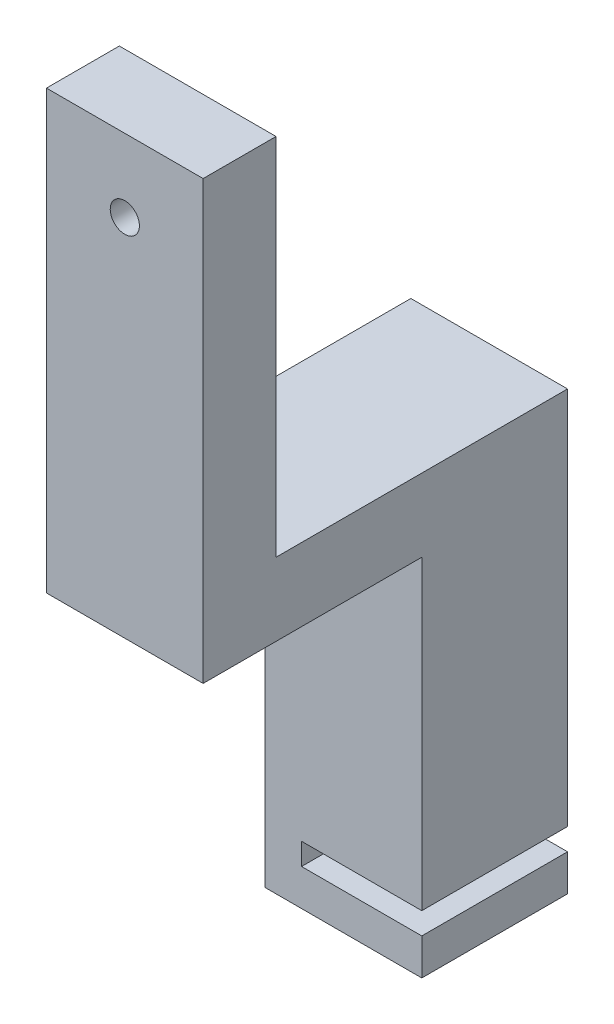
ISO-10303-21;
HEADER;
FILE_DESCRIPTION(('STEP AP214'),'2;1');
FILE_NAME('part.step','',(''),(''),'','','');
FILE_SCHEMA(('AUTOMOTIVE_DESIGN { 1 0 10303 214 1 1 1 1 }'));
ENDSEC;
DATA;
#1=APPLICATION_CONTEXT('core data for automotive mechanical design processes');
#2=APPLICATION_PROTOCOL_DEFINITION('international standard','automotive_design',2000,#1);
#3=PRODUCT_CONTEXT('',#1,'mechanical');
#4=PRODUCT('Part','Part','',(#3));
#5=PRODUCT_RELATED_PRODUCT_CATEGORY('part','',(#4));
#6=PRODUCT_DEFINITION_FORMATION('','',#4);
#7=PRODUCT_DEFINITION_CONTEXT('part definition',#1,'design');
#8=PRODUCT_DEFINITION('design','',#6,#7);
#9=PRODUCT_DEFINITION_SHAPE('','',#8);
#10=(LENGTH_UNIT() NAMED_UNIT(*) SI_UNIT(.MILLI.,.METRE.));
#11=(NAMED_UNIT(*) PLANE_ANGLE_UNIT() SI_UNIT($,.RADIAN.));
#12=(NAMED_UNIT(*) SI_UNIT($,.STERADIAN.) SOLID_ANGLE_UNIT());
#13=UNCERTAINTY_MEASURE_WITH_UNIT(LENGTH_MEASURE(1.E-05),#10,'distance_accuracy_value','');
#14=(GEOMETRIC_REPRESENTATION_CONTEXT(3) GLOBAL_UNCERTAINTY_ASSIGNED_CONTEXT((#13)) GLOBAL_UNIT_ASSIGNED_CONTEXT((#10,
#11,#12)) REPRESENTATION_CONTEXT('',''));
#15=CARTESIAN_POINT('',(0.,0.,0.));
#16=DIRECTION('',(0.,0.,1.));
#17=DIRECTION('',(1.,0.,0.));
#18=AXIS2_PLACEMENT_3D('',#15,#16,#17);
#19=CARTESIAN_POINT('',(0.,0.,20.));
#20=DIRECTION('',(-1.,0.,0.));
#21=DIRECTION('',(0.,-1.,0.));
#22=AXIS2_PLACEMENT_3D('',#19,#20,#21);
#23=PLANE('',#22);
#24=DIRECTION('',(0.,1.,0.));
#25=VECTOR('',#24,1.);
#26=CARTESIAN_POINT('',(0.,0.,0.));
#27=LINE('',#26,#25);
#28=CARTESIAN_POINT('',(0.,0.,0.));
#29=VERTEX_POINT('',#28);
#30=CARTESIAN_POINT('',(0.,5.,0.));
#31=VERTEX_POINT('',#30);
#32=EDGE_CURVE('E217',#29,#31,#27,.T.);
#33=ORIENTED_EDGE('',*,*,#32,.T.);
#34=DIRECTION('',(0.,0.,-1.));
#35=VECTOR('',#34,1.);
#36=CARTESIAN_POINT('',(0.,5.,20.));
#37=LINE('',#36,#35);
#38=CARTESIAN_POINT('',(0.,5.,20.));
#39=VERTEX_POINT('',#38);
#40=EDGE_CURVE('E175',#39,#31,#37,.T.);
#41=ORIENTED_EDGE('',*,*,#40,.F.);
#42=DIRECTION('',(0.,1.,0.));
#43=VECTOR('',#42,1.);
#44=CARTESIAN_POINT('',(0.,0.,20.));
#45=LINE('',#44,#43);
#46=CARTESIAN_POINT('',(0.,0.,20.));
#47=VERTEX_POINT('',#46);
#48=EDGE_CURVE('E202',#47,#39,#45,.T.);
#49=ORIENTED_EDGE('',*,*,#48,.F.);
#50=DIRECTION('',(0.,0.,-1.));
#51=VECTOR('',#50,1.);
#52=CARTESIAN_POINT('',(0.,0.,20.));
#53=LINE('',#52,#51);
#54=EDGE_CURVE('E203',#47,#29,#53,.T.);
#55=ORIENTED_EDGE('',*,*,#54,.T.);
#56=EDGE_LOOP('',(#33,#41,#49,#55));
#57=FACE_BOUND('',#56,.T.);
#58=ADVANCED_FACE('F41',(#57),#23,.F.);
#59=CARTESIAN_POINT('',(0.,5.,20.));
#60=DIRECTION('',(0.,-1.,0.));
#61=DIRECTION('',(1.,0.,0.));
#62=AXIS2_PLACEMENT_3D('',#59,#60,#61);
#63=PLANE('',#62);
#64=DIRECTION('',(-1.,0.,0.));
#65=VECTOR('',#64,1.);
#66=CARTESIAN_POINT('',(0.,5.,0.));
#67=LINE('',#66,#65);
#68=CARTESIAN_POINT('',(-16.5,5.,0.));
#69=VERTEX_POINT('',#68);
#70=EDGE_CURVE('E219',#31,#69,#67,.T.);
#71=ORIENTED_EDGE('',*,*,#70,.T.);
#72=DIRECTION('',(0.,0.,-1.));
#73=VECTOR('',#72,1.);
#74=CARTESIAN_POINT('',(-16.5,5.,20.));
#75=LINE('',#74,#73);
#76=CARTESIAN_POINT('',(-16.5,5.,20.));
#77=VERTEX_POINT('',#76);
#78=EDGE_CURVE('E171',#77,#69,#75,.T.);
#79=ORIENTED_EDGE('',*,*,#78,.F.);
#80=DIRECTION('',(-1.,0.,0.));
#81=VECTOR('',#80,1.);
#82=CARTESIAN_POINT('',(0.,5.,20.));
#83=LINE('',#82,#81);
#84=EDGE_CURVE('E249',#39,#77,#83,.T.);
#85=ORIENTED_EDGE('',*,*,#84,.F.);
#86=ORIENTED_EDGE('',*,*,#40,.T.);
#87=EDGE_LOOP('',(#71,#79,#85,#86));
#88=FACE_BOUND('',#87,.T.);
#89=ADVANCED_FACE('F311',(#88),#63,.F.);
#90=CARTESIAN_POINT('',(-16.5,8.,20.));
#91=DIRECTION('',(-1.,0.,0.));
#92=DIRECTION('',(0.,0.,1.));
#93=AXIS2_PLACEMENT_3D('',#90,#91,#92);
#94=PLANE('',#93);
#95=DIRECTION('',(0.,1.,0.));
#96=VECTOR('',#95,1.);
#97=CARTESIAN_POINT('',(-16.5,8.,0.));
#98=LINE('',#97,#96);
#99=CARTESIAN_POINT('',(-16.5,8.,0.));
#100=VERTEX_POINT('',#99);
#101=EDGE_CURVE('E196',#69,#100,#98,.T.);
#102=ORIENTED_EDGE('',*,*,#101,.T.);
#103=DIRECTION('',(0.,0.,-1.));
#104=VECTOR('',#103,1.);
#105=CARTESIAN_POINT('',(-16.5,8.,20.));
#106=LINE('',#105,#104);
#107=CARTESIAN_POINT('',(-16.5,8.,20.));
#108=VERTEX_POINT('',#107);
#109=EDGE_CURVE('E162',#108,#100,#106,.T.);
#110=ORIENTED_EDGE('',*,*,#109,.F.);
#111=DIRECTION('',(0.,1.,0.));
#112=VECTOR('',#111,1.);
#113=CARTESIAN_POINT('',(-16.5,8.,20.));
#114=LINE('',#113,#112);
#115=EDGE_CURVE('E243',#77,#108,#114,.T.);
#116=ORIENTED_EDGE('',*,*,#115,.F.);
#117=ORIENTED_EDGE('',*,*,#78,.T.);
#118=EDGE_LOOP('',(#102,#110,#116,#117));
#119=FACE_BOUND('',#118,.T.);
#120=ADVANCED_FACE('F235',(#119),#94,.F.);
#121=CARTESIAN_POINT('',(0.,8.,20.));
#122=DIRECTION('',(0.,1.,0.));
#123=DIRECTION('',(-1.,0.,0.));
#124=AXIS2_PLACEMENT_3D('',#121,#122,#123);
#125=PLANE('',#124);
#126=DIRECTION('',(1.,0.,0.));
#127=VECTOR('',#126,1.);
#128=CARTESIAN_POINT('',(0.,8.,0.));
#129=LINE('',#128,#127);
#130=CARTESIAN_POINT('',(0.,8.,0.));
#131=VERTEX_POINT('',#130);
#132=EDGE_CURVE('E190',#100,#131,#129,.T.);
#133=ORIENTED_EDGE('',*,*,#132,.T.);
#134=DIRECTION('',(0.,0.,-1.));
#135=VECTOR('',#134,1.);
#136=CARTESIAN_POINT('',(0.,8.,20.));
#137=LINE('',#136,#135);
#138=CARTESIAN_POINT('',(0.,8.,20.));
#139=VERTEX_POINT('',#138);
#140=EDGE_CURVE('E156',#139,#131,#137,.T.);
#141=ORIENTED_EDGE('',*,*,#140,.F.);
#142=DIRECTION('',(1.,0.,0.));
#143=VECTOR('',#142,1.);
#144=CARTESIAN_POINT('',(0.,8.,20.));
#145=LINE('',#144,#143);
#146=EDGE_CURVE('E241',#108,#139,#145,.T.);
#147=ORIENTED_EDGE('',*,*,#146,.F.);
#148=ORIENTED_EDGE('',*,*,#109,.T.);
#149=EDGE_LOOP('',(#133,#141,#147,#148));
#150=FACE_BOUND('',#149,.T.);
#151=ADVANCED_FACE('F240',(#150),#125,.F.);
#152=CARTESIAN_POINT('',(0.,50.,20.));
#153=DIRECTION('',(-1.,0.,0.));
#154=DIRECTION('',(0.,0.,1.));
#155=AXIS2_PLACEMENT_3D('',#152,#153,#154);
#156=PLANE('',#155);
#157=DIRECTION('',(0.,1.,0.));
#158=VECTOR('',#157,1.);
#159=CARTESIAN_POINT('',(0.,50.,0.));
#160=LINE('',#159,#158);
#161=CARTESIAN_POINT('',(0.,60.,0.));
#162=VERTEX_POINT('',#161);
#163=EDGE_CURVE('E183',#131,#162,#160,.T.);
#164=ORIENTED_EDGE('',*,*,#163,.T.);
#165=DIRECTION('',(0.,0.,-1.));
#166=VECTOR('',#165,1.);
#167=CARTESIAN_POINT('',(0.,60.,0.));
#168=LINE('',#167,#166);
#169=CARTESIAN_POINT('',(0.,60.,40.));
#170=VERTEX_POINT('',#169);
#171=EDGE_CURVE('E56',#170,#162,#168,.T.);
#172=ORIENTED_EDGE('',*,*,#171,.F.);
#173=DIRECTION('',(0.,-1.,0.));
#174=VECTOR('',#173,1.);
#175=CARTESIAN_POINT('',(0.,110.,40.));
#176=LINE('',#175,#174);
#177=CARTESIAN_POINT('',(0.,110.,40.));
#178=VERTEX_POINT('',#177);
#179=EDGE_CURVE('E135',#178,#170,#176,.T.);
#180=ORIENTED_EDGE('',*,*,#179,.F.);
#181=DIRECTION('',(0.,0.,-1.));
#182=VECTOR('',#181,1.);
#183=CARTESIAN_POINT('',(0.,110.,20.));
#184=LINE('',#183,#182);
#185=CARTESIAN_POINT('',(0.,110.,50.));
#186=VERTEX_POINT('',#185);
#187=EDGE_CURVE('E146',#186,#178,#184,.T.);
#188=ORIENTED_EDGE('',*,*,#187,.F.);
#189=DIRECTION('',(0.,1.,0.));
#190=VECTOR('',#189,1.);
#191=CARTESIAN_POINT('',(0.,0.,50.));
#192=LINE('',#191,#190);
#193=CARTESIAN_POINT('',(0.,50.,50.));
#194=VERTEX_POINT('',#193);
#195=EDGE_CURVE('E274',#194,#186,#192,.T.);
#196=ORIENTED_EDGE('',*,*,#195,.F.);
#197=DIRECTION('',(0.,0.,-1.));
#198=VECTOR('',#197,1.);
#199=CARTESIAN_POINT('',(0.,50.,50.));
#200=LINE('',#199,#198);
#201=CARTESIAN_POINT('',(0.,50.,20.));
#202=VERTEX_POINT('',#201);
#203=EDGE_CURVE('E228',#194,#202,#200,.T.);
#204=ORIENTED_EDGE('',*,*,#203,.T.);
#205=DIRECTION('',(0.,1.,0.));
#206=VECTOR('',#205,1.);
#207=CARTESIAN_POINT('',(0.,8.,20.));
#208=LINE('',#207,#206);
#209=EDGE_CURVE('E64',#139,#202,#208,.T.);
#210=ORIENTED_EDGE('',*,*,#209,.F.);
#211=ORIENTED_EDGE('',*,*,#140,.T.);
#212=EDGE_LOOP('',(#164,#172,#180,#188,#196,#204,#210,#211));
#213=FACE_BOUND('',#212,.T.);
#214=ADVANCED_FACE('F144',(#213),#156,.F.);
#215=CARTESIAN_POINT('',(-21.5,110.,20.));
#216=DIRECTION('',(0.,-1.,0.));
#217=DIRECTION('',(0.,0.,-1.));
#218=AXIS2_PLACEMENT_3D('',#215,#216,#217);
#219=PLANE('',#218);
#220=ORIENTED_EDGE('',*,*,#187,.T.);
#221=DIRECTION('',(1.,0.,0.));
#222=VECTOR('',#221,1.);
#223=CARTESIAN_POINT('',(-50.,110.,40.));
#224=LINE('',#223,#222);
#225=CARTESIAN_POINT('',(-21.5,110.,40.));
#226=VERTEX_POINT('',#225);
#227=EDGE_CURVE('E131',#226,#178,#224,.T.);
#228=ORIENTED_EDGE('',*,*,#227,.F.);
#229=DIRECTION('',(0.,0.,-1.));
#230=VECTOR('',#229,1.);
#231=CARTESIAN_POINT('',(-21.5,110.,20.));
#232=LINE('',#231,#230);
#233=CARTESIAN_POINT('',(-21.5,110.,50.));
#234=VERTEX_POINT('',#233);
#235=EDGE_CURVE('E157',#234,#226,#232,.T.);
#236=ORIENTED_EDGE('',*,*,#235,.F.);
#237=DIRECTION('',(1.,0.,0.));
#238=VECTOR('',#237,1.);
#239=CARTESIAN_POINT('',(0.,110.,50.));
#240=LINE('',#239,#238);
#241=EDGE_CURVE('E154',#234,#186,#240,.T.);
#242=ORIENTED_EDGE('',*,*,#241,.T.);
#243=EDGE_LOOP('',(#220,#228,#236,#242));
#244=FACE_BOUND('',#243,.T.);
#245=ADVANCED_FACE('F152',(#244),#219,.F.);
#246=CARTESIAN_POINT('',(-21.5,0.,20.));
#247=DIRECTION('',(1.,0.,0.));
#248=DIRECTION('',(0.,0.,-1.));
#249=AXIS2_PLACEMENT_3D('',#246,#247,#248);
#250=PLANE('',#249);
#251=DIRECTION('',(0.,-1.,0.));
#252=VECTOR('',#251,1.);
#253=CARTESIAN_POINT('',(-21.5,0.,40.));
#254=LINE('',#253,#252);
#255=CARTESIAN_POINT('',(-21.5,60.,40.));
#256=VERTEX_POINT('',#255);
#257=EDGE_CURVE('E11',#226,#256,#254,.T.);
#258=ORIENTED_EDGE('',*,*,#257,.T.);
#259=DIRECTION('',(0.,0.,-1.));
#260=VECTOR('',#259,1.);
#261=CARTESIAN_POINT('',(-21.5,60.,20.));
#262=LINE('',#261,#260);
#263=CARTESIAN_POINT('',(-21.5,60.,0.));
#264=VERTEX_POINT('',#263);
#265=EDGE_CURVE('E281',#256,#264,#262,.T.);
#266=ORIENTED_EDGE('',*,*,#265,.T.);
#267=DIRECTION('',(0.,-1.,0.));
#268=VECTOR('',#267,1.);
#269=CARTESIAN_POINT('',(-21.5,0.,0.));
#270=LINE('',#269,#268);
#271=CARTESIAN_POINT('',(-21.5,0.,0.));
#272=VERTEX_POINT('',#271);
#273=EDGE_CURVE('E186',#264,#272,#270,.T.);
#274=ORIENTED_EDGE('',*,*,#273,.T.);
#275=DIRECTION('',(0.,0.,-1.));
#276=VECTOR('',#275,1.);
#277=CARTESIAN_POINT('',(-21.5,0.,20.));
#278=LINE('',#277,#276);
#279=CARTESIAN_POINT('',(-21.5,0.,20.));
#280=VERTEX_POINT('',#279);
#281=EDGE_CURVE('E164',#280,#272,#278,.T.);
#282=ORIENTED_EDGE('',*,*,#281,.F.);
#283=DIRECTION('',(0.,-1.,0.));
#284=VECTOR('',#283,1.);
#285=CARTESIAN_POINT('',(-21.5,50.,20.));
#286=LINE('',#285,#284);
#287=CARTESIAN_POINT('',(-21.5,50.,20.));
#288=VERTEX_POINT('',#287);
#289=EDGE_CURVE('E247',#288,#280,#286,.T.);
#290=ORIENTED_EDGE('',*,*,#289,.F.);
#291=DIRECTION('',(0.,0.,-1.));
#292=VECTOR('',#291,1.);
#293=CARTESIAN_POINT('',(-21.5,50.,50.));
#294=LINE('',#293,#292);
#295=CARTESIAN_POINT('',(-21.5,50.,50.));
#296=VERTEX_POINT('',#295);
#297=EDGE_CURVE('E264',#296,#288,#294,.T.);
#298=ORIENTED_EDGE('',*,*,#297,.F.);
#299=DIRECTION('',(0.,1.,0.));
#300=VECTOR('',#299,1.);
#301=CARTESIAN_POINT('',(-21.5,0.,50.));
#302=LINE('',#301,#300);
#303=EDGE_CURVE('E268',#296,#234,#302,.T.);
#304=ORIENTED_EDGE('',*,*,#303,.T.);
#305=ORIENTED_EDGE('',*,*,#235,.T.);
#306=EDGE_LOOP('',(#258,#266,#274,#282,#290,#298,#304,#305));
#307=FACE_BOUND('',#306,.T.);
#308=ADVANCED_FACE('F327',(#307),#250,.F.);
#309=CARTESIAN_POINT('',(0.,0.,20.));
#310=DIRECTION('',(0.,1.,0.));
#311=DIRECTION('',(0.,0.,1.));
#312=AXIS2_PLACEMENT_3D('',#309,#310,#311);
#313=PLANE('',#312);
#314=DIRECTION('',(1.,0.,0.));
#315=VECTOR('',#314,1.);
#316=CARTESIAN_POINT('',(0.,0.,0.));
#317=LINE('',#316,#315);
#318=EDGE_CURVE('E194',#272,#29,#317,.T.);
#319=ORIENTED_EDGE('',*,*,#318,.T.);
#320=ORIENTED_EDGE('',*,*,#54,.F.);
#321=DIRECTION('',(1.,0.,0.));
#322=VECTOR('',#321,1.);
#323=CARTESIAN_POINT('',(0.,0.,20.));
#324=LINE('',#323,#322);
#325=EDGE_CURVE('E206',#280,#47,#324,.T.);
#326=ORIENTED_EDGE('',*,*,#325,.F.);
#327=ORIENTED_EDGE('',*,*,#281,.T.);
#328=EDGE_LOOP('',(#319,#320,#326,#327));
#329=FACE_BOUND('',#328,.T.);
#330=ADVANCED_FACE('F212',(#329),#313,.F.);
#331=CARTESIAN_POINT('',(0.,0.,20.));
#332=DIRECTION('',(0.,0.,1.));
#333=DIRECTION('',(1.,0.,0.));
#334=AXIS2_PLACEMENT_3D('',#331,#332,#333);
#335=PLANE('',#334);
#336=DIRECTION('',(1.,0.,0.));
#337=VECTOR('',#336,1.);
#338=CARTESIAN_POINT('',(0.,50.,20.));
#339=LINE('',#338,#337);
#340=EDGE_CURVE('E223',#288,#202,#339,.T.);
#341=ORIENTED_EDGE('',*,*,#340,.F.);
#342=ORIENTED_EDGE('',*,*,#289,.T.);
#343=ORIENTED_EDGE('',*,*,#325,.T.);
#344=ORIENTED_EDGE('',*,*,#48,.T.);
#345=ORIENTED_EDGE('',*,*,#84,.T.);
#346=ORIENTED_EDGE('',*,*,#115,.T.);
#347=ORIENTED_EDGE('',*,*,#146,.T.);
#348=ORIENTED_EDGE('',*,*,#209,.T.);
#349=EDGE_LOOP('',(#341,#342,#343,#344,#345,#346,#347,#348));
#350=FACE_BOUND('',#349,.T.);
#351=ADVANCED_FACE('F255',(#350),#335,.T.);
#352=CARTESIAN_POINT('',(0.,0.,0.));
#353=DIRECTION('',(0.,0.,1.));
#354=DIRECTION('',(1.,0.,0.));
#355=AXIS2_PLACEMENT_3D('',#352,#353,#354);
#356=PLANE('',#355);
#357=ORIENTED_EDGE('',*,*,#273,.F.);
#358=DIRECTION('',(1.,0.,0.));
#359=VECTOR('',#358,1.);
#360=CARTESIAN_POINT('',(0.,60.,0.));
#361=LINE('',#360,#359);
#362=EDGE_CURVE('E49',#264,#162,#361,.T.);
#363=ORIENTED_EDGE('',*,*,#362,.T.);
#364=ORIENTED_EDGE('',*,*,#163,.F.);
#365=ORIENTED_EDGE('',*,*,#132,.F.);
#366=ORIENTED_EDGE('',*,*,#101,.F.);
#367=ORIENTED_EDGE('',*,*,#70,.F.);
#368=ORIENTED_EDGE('',*,*,#32,.F.);
#369=ORIENTED_EDGE('',*,*,#318,.F.);
#370=EDGE_LOOP('',(#357,#363,#364,#365,#366,#367,#368,#369));
#371=FACE_BOUND('',#370,.T.);
#372=ADVANCED_FACE('F181',(#371),#356,.F.);
#373=CARTESIAN_POINT('',(0.,50.,50.));
#374=DIRECTION('',(0.,-1.,0.));
#375=DIRECTION('',(0.,0.,-1.));
#376=AXIS2_PLACEMENT_3D('',#373,#374,#375);
#377=PLANE('',#376);
#378=ORIENTED_EDGE('',*,*,#297,.T.);
#379=ORIENTED_EDGE('',*,*,#340,.T.);
#380=ORIENTED_EDGE('',*,*,#203,.F.);
#381=DIRECTION('',(-1.,0.,0.));
#382=VECTOR('',#381,1.);
#383=CARTESIAN_POINT('',(0.,50.,50.));
#384=LINE('',#383,#382);
#385=EDGE_CURVE('E277',#194,#296,#384,.T.);
#386=ORIENTED_EDGE('',*,*,#385,.T.);
#387=EDGE_LOOP('',(#378,#379,#380,#386));
#388=FACE_BOUND('',#387,.T.);
#389=ADVANCED_FACE('F307',(#388),#377,.T.);
#390=CARTESIAN_POINT('',(0.,0.,50.));
#391=DIRECTION('',(0.,0.,1.));
#392=DIRECTION('',(1.,0.,0.));
#393=AXIS2_PLACEMENT_3D('',#390,#391,#392);
#394=PLANE('',#393);
#395=CARTESIAN_POINT('',(-10.75,100.,50.));
#396=DIRECTION('',(0.,0.,1.));
#397=DIRECTION('',(1.,0.,0.));
#398=AXIS2_PLACEMENT_3D('',#395,#396,#397);
#399=CIRCLE('',#398,2.);
#400=CARTESIAN_POINT('',(-8.75,100.,50.));
#401=VERTEX_POINT('',#400);
#402=EDGE_CURVE('E149',#401,#401,#399,.T.);
#403=ORIENTED_EDGE('',*,*,#402,.F.);
#404=EDGE_LOOP('',(#403));
#405=FACE_BOUND('',#404,.T.);
#406=ORIENTED_EDGE('',*,*,#385,.F.);
#407=ORIENTED_EDGE('',*,*,#195,.T.);
#408=ORIENTED_EDGE('',*,*,#241,.F.);
#409=ORIENTED_EDGE('',*,*,#303,.F.);
#410=EDGE_LOOP('',(#406,#407,#408,#409));
#411=FACE_BOUND('',#410,.T.);
#412=ADVANCED_FACE('F300',(#405,#411),#394,.T.);
#413=CARTESIAN_POINT('',(-50.,110.,40.));
#414=DIRECTION('',(0.,0.,1.));
#415=DIRECTION('',(0.,-1.,0.));
#416=AXIS2_PLACEMENT_3D('',#413,#414,#415);
#417=PLANE('',#416);
#418=CARTESIAN_POINT('',(-10.75,100.,40.));
#419=DIRECTION('',(0.,0.,-1.));
#420=DIRECTION('',(0.,1.,0.));
#421=AXIS2_PLACEMENT_3D('',#418,#419,#420);
#422=CIRCLE('',#421,2.);
#423=CARTESIAN_POINT('',(-10.75,102.,40.));
#424=VERTEX_POINT('',#423);
#425=EDGE_CURVE('E291',#424,#424,#422,.T.);
#426=ORIENTED_EDGE('',*,*,#425,.F.);
#427=EDGE_LOOP('',(#426));
#428=FACE_BOUND('',#427,.T.);
#429=ORIENTED_EDGE('',*,*,#227,.T.);
#430=ORIENTED_EDGE('',*,*,#179,.T.);
#431=DIRECTION('',(1.,0.,0.));
#432=VECTOR('',#431,1.);
#433=CARTESIAN_POINT('',(-50.,60.,40.));
#434=LINE('',#433,#432);
#435=EDGE_CURVE('E140',#256,#170,#434,.T.);
#436=ORIENTED_EDGE('',*,*,#435,.F.);
#437=ORIENTED_EDGE('',*,*,#257,.F.);
#438=EDGE_LOOP('',(#429,#430,#436,#437));
#439=FACE_BOUND('',#438,.T.);
#440=ADVANCED_FACE('F133',(#428,#439),#417,.F.);
#441=CARTESIAN_POINT('',(-50.,60.,0.));
#442=DIRECTION('',(0.,-1.,0.));
#443=DIRECTION('',(0.,0.,-1.));
#444=AXIS2_PLACEMENT_3D('',#441,#442,#443);
#445=PLANE('',#444);
#446=ORIENTED_EDGE('',*,*,#435,.T.);
#447=ORIENTED_EDGE('',*,*,#171,.T.);
#448=ORIENTED_EDGE('',*,*,#362,.F.);
#449=ORIENTED_EDGE('',*,*,#265,.F.);
#450=EDGE_LOOP('',(#446,#447,#448,#449));
#451=FACE_BOUND('',#450,.T.);
#452=ADVANCED_FACE('F299',(#451),#445,.F.);
#453=CARTESIAN_POINT('',(-10.75,100.,90.));
#454=DIRECTION('',(0.,0.,-1.));
#455=DIRECTION('',(0.,1.,0.));
#456=AXIS2_PLACEMENT_3D('',#453,#454,#455);
#457=CYLINDRICAL_SURFACE('',#456,2.);
#458=ORIENTED_EDGE('',*,*,#402,.T.);
#459=EDGE_LOOP('',(#458));
#460=FACE_BOUND('',#459,.T.);
#461=ORIENTED_EDGE('',*,*,#425,.T.);
#462=EDGE_LOOP('',(#461));
#463=FACE_BOUND('',#462,.T.);
#464=ADVANCED_FACE('F296',(#460,#463),#457,.F.);
#465=CLOSED_SHELL('',(#58,#89,#120,#151,#214,#245,#308,#330,#351,#372,#389,#412,#440,#452,#464));
#466=MANIFOLD_SOLID_BREP('B2',#465);
#467=ADVANCED_BREP_SHAPE_REPRESENTATION('',(#18,#466),#14);
#468=SHAPE_DEFINITION_REPRESENTATION(#9,#467);
ENDSEC;
END-ISO-10303-21;
